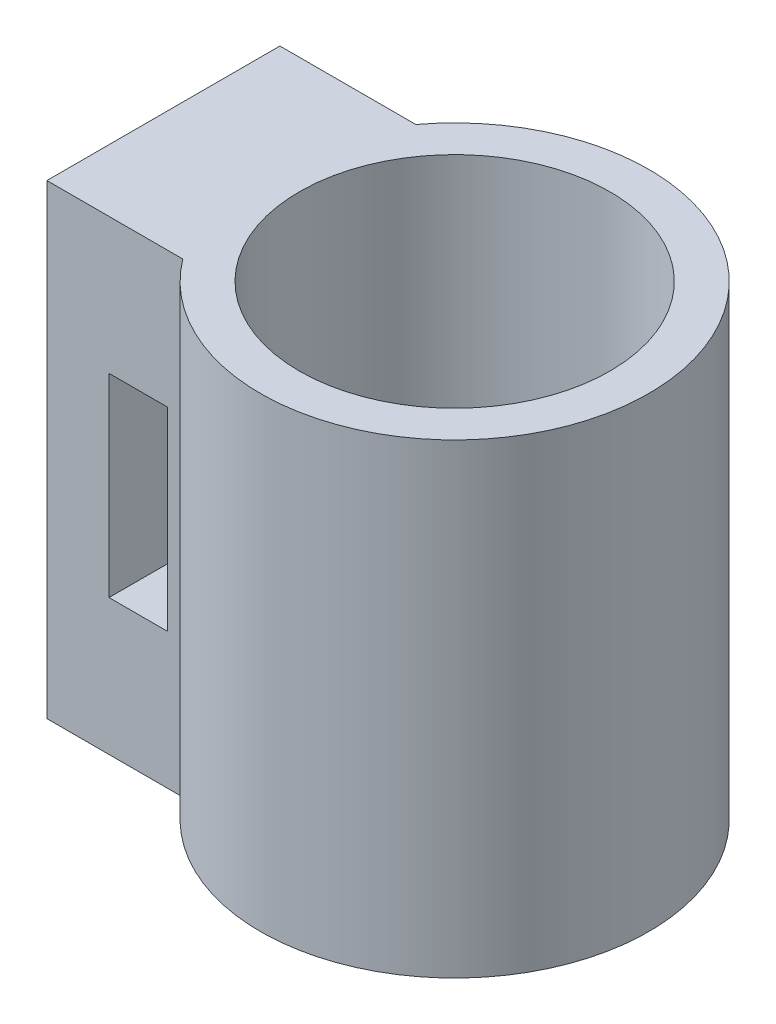
ISO-10303-21;
HEADER;
FILE_DESCRIPTION(('STEP AP214'),'2;1');
FILE_NAME('part.step','',(''),(''),'','','');
FILE_SCHEMA(('AUTOMOTIVE_DESIGN { 1 0 10303 214 1 1 1 1 }'));
ENDSEC;
DATA;
#1=APPLICATION_CONTEXT('core data for automotive mechanical design processes');
#2=APPLICATION_PROTOCOL_DEFINITION('international standard','automotive_design',2000,#1);
#3=PRODUCT_CONTEXT('',#1,'mechanical');
#4=PRODUCT('Part','Part','',(#3));
#5=PRODUCT_RELATED_PRODUCT_CATEGORY('part','',(#4));
#6=PRODUCT_DEFINITION_FORMATION('','',#4);
#7=PRODUCT_DEFINITION_CONTEXT('part definition',#1,'design');
#8=PRODUCT_DEFINITION('design','',#6,#7);
#9=PRODUCT_DEFINITION_SHAPE('','',#8);
#10=(LENGTH_UNIT() NAMED_UNIT(*) SI_UNIT(.MILLI.,.METRE.));
#11=(NAMED_UNIT(*) PLANE_ANGLE_UNIT() SI_UNIT($,.RADIAN.));
#12=(NAMED_UNIT(*) SI_UNIT($,.STERADIAN.) SOLID_ANGLE_UNIT());
#13=UNCERTAINTY_MEASURE_WITH_UNIT(LENGTH_MEASURE(1.E-05),#10,'distance_accuracy_value','');
#14=(GEOMETRIC_REPRESENTATION_CONTEXT(3) GLOBAL_UNCERTAINTY_ASSIGNED_CONTEXT((#13)) GLOBAL_UNIT_ASSIGNED_CONTEXT((#10,
#11,#12)) REPRESENTATION_CONTEXT('',''));
#15=CARTESIAN_POINT('',(0.,0.,0.));
#16=DIRECTION('',(0.,0.,1.));
#17=DIRECTION('',(1.,0.,0.));
#18=AXIS2_PLACEMENT_3D('',#15,#16,#17);
#19=CARTESIAN_POINT('',(0.,-6.,0.));
#20=DIRECTION('',(0.,1.,0.));
#21=DIRECTION('',(0.,0.,1.));
#22=AXIS2_PLACEMENT_3D('',#19,#20,#21);
#23=CYLINDRICAL_SURFACE('',#22,5.);
#24=DIRECTION('',(0.,1.,0.));
#25=VECTOR('',#24,1.);
#26=CARTESIAN_POINT('',(-4.,-6.,-3.));
#27=LINE('',#26,#25);
#28=CARTESIAN_POINT('',(-4.,-6.,-3.));
#29=VERTEX_POINT('',#28);
#30=CARTESIAN_POINT('',(-4.,6.,-3.));
#31=VERTEX_POINT('',#30);
#32=EDGE_CURVE('E42',#29,#31,#27,.T.);
#33=ORIENTED_EDGE('',*,*,#32,.T.);
#34=CARTESIAN_POINT('',(0.,6.,0.));
#35=DIRECTION('',(0.,1.,0.));
#36=DIRECTION('',(0.,0.,1.));
#37=AXIS2_PLACEMENT_3D('',#34,#35,#36);
#38=CIRCLE('',#37,5.);
#39=CARTESIAN_POINT('',(-4.,6.,3.));
#40=VERTEX_POINT('',#39);
#41=EDGE_CURVE('E155',#40,#31,#38,.T.);
#42=ORIENTED_EDGE('',*,*,#41,.F.);
#43=DIRECTION('',(0.,1.,0.));
#44=VECTOR('',#43,1.);
#45=CARTESIAN_POINT('',(-4.,-6.,3.));
#46=LINE('',#45,#44);
#47=CARTESIAN_POINT('',(-4.,-6.,3.));
#48=VERTEX_POINT('',#47);
#49=EDGE_CURVE('E11',#48,#40,#46,.T.);
#50=ORIENTED_EDGE('',*,*,#49,.F.);
#51=CARTESIAN_POINT('',(0.,-6.,0.));
#52=DIRECTION('',(0.,1.,0.));
#53=DIRECTION('',(0.,0.,1.));
#54=AXIS2_PLACEMENT_3D('',#51,#52,#53);
#55=CIRCLE('',#54,5.);
#56=EDGE_CURVE('E175',#48,#29,#55,.T.);
#57=ORIENTED_EDGE('',*,*,#56,.T.);
#58=EDGE_LOOP('',(#33,#42,#50,#57));
#59=FACE_BOUND('',#58,.T.);
#60=ADVANCED_FACE('F39',(#59),#23,.T.);
#61=CARTESIAN_POINT('',(-4.,-6.,3.));
#62=DIRECTION('',(0.,0.,1.));
#63=DIRECTION('',(1.,0.,0.));
#64=AXIS2_PLACEMENT_3D('',#61,#62,#63);
#65=PLANE('',#64);
#66=DIRECTION('',(-1.,0.,0.));
#67=VECTOR('',#66,1.);
#68=CARTESIAN_POINT('',(-4.,2.5,3.));
#69=LINE('',#68,#67);
#70=CARTESIAN_POINT('',(-4.4,2.5,3.));
#71=VERTEX_POINT('',#70);
#72=CARTESIAN_POINT('',(-5.9,2.5,3.));
#73=VERTEX_POINT('',#72);
#74=EDGE_CURVE('E148',#71,#73,#69,.T.);
#75=ORIENTED_EDGE('',*,*,#74,.F.);
#76=DIRECTION('',(0.,1.,0.));
#77=VECTOR('',#76,1.);
#78=CARTESIAN_POINT('',(-4.4,-6.,3.));
#79=LINE('',#78,#77);
#80=CARTESIAN_POINT('',(-4.4,-2.5,3.));
#81=VERTEX_POINT('',#80);
#82=EDGE_CURVE('E136',#81,#71,#79,.T.);
#83=ORIENTED_EDGE('',*,*,#82,.F.);
#84=DIRECTION('',(1.,0.,0.));
#85=VECTOR('',#84,1.);
#86=CARTESIAN_POINT('',(-4.,-2.5,3.));
#87=LINE('',#86,#85);
#88=CARTESIAN_POINT('',(-5.9,-2.5,3.));
#89=VERTEX_POINT('',#88);
#90=EDGE_CURVE('E111',#89,#81,#87,.T.);
#91=ORIENTED_EDGE('',*,*,#90,.F.);
#92=DIRECTION('',(0.,-1.,0.));
#93=VECTOR('',#92,1.);
#94=CARTESIAN_POINT('',(-5.9,-6.,3.));
#95=LINE('',#94,#93);
#96=EDGE_CURVE('E145',#73,#89,#95,.T.);
#97=ORIENTED_EDGE('',*,*,#96,.F.);
#98=EDGE_LOOP('',(#75,#83,#91,#97));
#99=FACE_BOUND('',#98,.T.);
#100=ORIENTED_EDGE('',*,*,#49,.T.);
#101=DIRECTION('',(1.,0.,0.));
#102=VECTOR('',#101,1.);
#103=CARTESIAN_POINT('',(-4.,6.,3.));
#104=LINE('',#103,#102);
#105=CARTESIAN_POINT('',(-7.5,6.,3.));
#106=VERTEX_POINT('',#105);
#107=EDGE_CURVE('E167',#106,#40,#104,.T.);
#108=ORIENTED_EDGE('',*,*,#107,.F.);
#109=DIRECTION('',(0.,1.,0.));
#110=VECTOR('',#109,1.);
#111=CARTESIAN_POINT('',(-7.5,-6.,3.));
#112=LINE('',#111,#110);
#113=CARTESIAN_POINT('',(-7.5,-6.,3.));
#114=VERTEX_POINT('',#113);
#115=EDGE_CURVE('E48',#114,#106,#112,.T.);
#116=ORIENTED_EDGE('',*,*,#115,.F.);
#117=DIRECTION('',(1.,0.,0.));
#118=VECTOR('',#117,1.);
#119=CARTESIAN_POINT('',(-4.,-6.,3.));
#120=LINE('',#119,#118);
#121=EDGE_CURVE('E187',#114,#48,#120,.T.);
#122=ORIENTED_EDGE('',*,*,#121,.T.);
#123=EDGE_LOOP('',(#100,#108,#116,#122));
#124=FACE_BOUND('',#123,.T.);
#125=ADVANCED_FACE('F206',(#99,#124),#65,.T.);
#126=CARTESIAN_POINT('',(-7.5,-6.,-3.));
#127=DIRECTION('',(-1.,0.,0.));
#128=DIRECTION('',(0.,0.,1.));
#129=AXIS2_PLACEMENT_3D('',#126,#127,#128);
#130=PLANE('',#129);
#131=ORIENTED_EDGE('',*,*,#115,.T.);
#132=DIRECTION('',(0.,0.,1.));
#133=VECTOR('',#132,1.);
#134=CARTESIAN_POINT('',(-7.5,6.,-3.));
#135=LINE('',#134,#133);
#136=CARTESIAN_POINT('',(-7.5,6.,-3.));
#137=VERTEX_POINT('',#136);
#138=EDGE_CURVE('E163',#137,#106,#135,.T.);
#139=ORIENTED_EDGE('',*,*,#138,.F.);
#140=DIRECTION('',(0.,1.,0.));
#141=VECTOR('',#140,1.);
#142=CARTESIAN_POINT('',(-7.5,-6.,-3.));
#143=LINE('',#142,#141);
#144=CARTESIAN_POINT('',(-7.5,-6.,-3.));
#145=VERTEX_POINT('',#144);
#146=EDGE_CURVE('E192',#145,#137,#143,.T.);
#147=ORIENTED_EDGE('',*,*,#146,.F.);
#148=DIRECTION('',(0.,0.,1.));
#149=VECTOR('',#148,1.);
#150=CARTESIAN_POINT('',(-7.5,-6.,-3.));
#151=LINE('',#150,#149);
#152=EDGE_CURVE('E183',#145,#114,#151,.T.);
#153=ORIENTED_EDGE('',*,*,#152,.T.);
#154=EDGE_LOOP('',(#131,#139,#147,#153));
#155=FACE_BOUND('',#154,.T.);
#156=ADVANCED_FACE('F212',(#155),#130,.T.);
#157=CARTESIAN_POINT('',(-4.,-6.,-3.));
#158=DIRECTION('',(0.,0.,-1.));
#159=DIRECTION('',(-1.,0.,0.));
#160=AXIS2_PLACEMENT_3D('',#157,#158,#159);
#161=PLANE('',#160);
#162=DIRECTION('',(1.,0.,0.));
#163=VECTOR('',#162,1.);
#164=CARTESIAN_POINT('',(-4.4,2.5,-3.));
#165=LINE('',#164,#163);
#166=CARTESIAN_POINT('',(-5.9,2.5,-3.));
#167=VERTEX_POINT('',#166);
#168=CARTESIAN_POINT('',(-4.4,2.5,-3.));
#169=VERTEX_POINT('',#168);
#170=EDGE_CURVE('E64',#167,#169,#165,.T.);
#171=ORIENTED_EDGE('',*,*,#170,.F.);
#172=DIRECTION('',(0.,1.,0.));
#173=VECTOR('',#172,1.);
#174=CARTESIAN_POINT('',(-5.9,2.5,-3.));
#175=LINE('',#174,#173);
#176=CARTESIAN_POINT('',(-5.9,-2.5,-3.));
#177=VERTEX_POINT('',#176);
#178=EDGE_CURVE('E126',#177,#167,#175,.T.);
#179=ORIENTED_EDGE('',*,*,#178,.F.);
#180=DIRECTION('',(-1.,0.,0.));
#181=VECTOR('',#180,1.);
#182=CARTESIAN_POINT('',(-4.4,-2.5,-3.));
#183=LINE('',#182,#181);
#184=CARTESIAN_POINT('',(-4.4,-2.5,-3.));
#185=VERTEX_POINT('',#184);
#186=EDGE_CURVE('E108',#185,#177,#183,.T.);
#187=ORIENTED_EDGE('',*,*,#186,.F.);
#188=DIRECTION('',(0.,-1.,0.));
#189=VECTOR('',#188,1.);
#190=CARTESIAN_POINT('',(-4.4,-2.5,-3.));
#191=LINE('',#190,#189);
#192=EDGE_CURVE('E118',#169,#185,#191,.T.);
#193=ORIENTED_EDGE('',*,*,#192,.F.);
#194=EDGE_LOOP('',(#171,#179,#187,#193));
#195=FACE_BOUND('',#194,.T.);
#196=ORIENTED_EDGE('',*,*,#146,.T.);
#197=DIRECTION('',(-1.,0.,0.));
#198=VECTOR('',#197,1.);
#199=CARTESIAN_POINT('',(-4.,6.,-3.));
#200=LINE('',#199,#198);
#201=EDGE_CURVE('E159',#31,#137,#200,.T.);
#202=ORIENTED_EDGE('',*,*,#201,.F.);
#203=ORIENTED_EDGE('',*,*,#32,.F.);
#204=DIRECTION('',(-1.,0.,0.));
#205=VECTOR('',#204,1.);
#206=CARTESIAN_POINT('',(-4.,-6.,-3.));
#207=LINE('',#206,#205);
#208=EDGE_CURVE('E179',#29,#145,#207,.T.);
#209=ORIENTED_EDGE('',*,*,#208,.T.);
#210=EDGE_LOOP('',(#196,#202,#203,#209));
#211=FACE_BOUND('',#210,.T.);
#212=ADVANCED_FACE('F123',(#195,#211),#161,.T.);
#213=CARTESIAN_POINT('',(0.,-6.,0.));
#214=DIRECTION('',(0.,1.,0.));
#215=DIRECTION('',(0.,0.,1.));
#216=AXIS2_PLACEMENT_3D('',#213,#214,#215);
#217=PLANE('',#216);
#218=CARTESIAN_POINT('',(0.,-6.,0.));
#219=DIRECTION('',(0.,1.,0.));
#220=DIRECTION('',(0.,0.,1.));
#221=AXIS2_PLACEMENT_3D('',#218,#219,#220);
#222=CIRCLE('',#221,4.);
#223=CARTESIAN_POINT('',(0.,-6.,4.));
#224=VERTEX_POINT('',#223);
#225=EDGE_CURVE('E171',#224,#224,#222,.T.);
#226=ORIENTED_EDGE('',*,*,#225,.T.);
#227=EDGE_LOOP('',(#226));
#228=FACE_BOUND('',#227,.T.);
#229=ORIENTED_EDGE('',*,*,#56,.F.);
#230=ORIENTED_EDGE('',*,*,#121,.F.);
#231=ORIENTED_EDGE('',*,*,#152,.F.);
#232=ORIENTED_EDGE('',*,*,#208,.F.);
#233=EDGE_LOOP('',(#229,#230,#231,#232));
#234=FACE_BOUND('',#233,.T.);
#235=ADVANCED_FACE('F209',(#228,#234),#217,.F.);
#236=CARTESIAN_POINT('',(0.,-6.,0.));
#237=DIRECTION('',(0.,1.,0.));
#238=DIRECTION('',(0.,0.,1.));
#239=AXIS2_PLACEMENT_3D('',#236,#237,#238);
#240=CYLINDRICAL_SURFACE('',#239,4.);
#241=ORIENTED_EDGE('',*,*,#225,.F.);
#242=EDGE_LOOP('',(#241));
#243=FACE_BOUND('',#242,.T.);
#244=CARTESIAN_POINT('',(0.,6.,0.));
#245=DIRECTION('',(0.,1.,0.));
#246=DIRECTION('',(0.,0.,1.));
#247=AXIS2_PLACEMENT_3D('',#244,#245,#246);
#248=CIRCLE('',#247,4.);
#249=CARTESIAN_POINT('',(0.,6.,4.));
#250=VERTEX_POINT('',#249);
#251=EDGE_CURVE('E151',#250,#250,#248,.T.);
#252=ORIENTED_EDGE('',*,*,#251,.T.);
#253=EDGE_LOOP('',(#252));
#254=FACE_BOUND('',#253,.T.);
#255=ADVANCED_FACE('F283',(#243,#254),#240,.F.);
#256=CARTESIAN_POINT('',(0.,6.,0.));
#257=DIRECTION('',(0.,1.,0.));
#258=DIRECTION('',(0.,0.,1.));
#259=AXIS2_PLACEMENT_3D('',#256,#257,#258);
#260=PLANE('',#259);
#261=ORIENTED_EDGE('',*,*,#41,.T.);
#262=ORIENTED_EDGE('',*,*,#201,.T.);
#263=ORIENTED_EDGE('',*,*,#138,.T.);
#264=ORIENTED_EDGE('',*,*,#107,.T.);
#265=EDGE_LOOP('',(#261,#262,#263,#264));
#266=FACE_BOUND('',#265,.T.);
#267=ORIENTED_EDGE('',*,*,#251,.F.);
#268=EDGE_LOOP('',(#267));
#269=FACE_BOUND('',#268,.T.);
#270=ADVANCED_FACE('F202',(#266,#269),#260,.T.);
#271=CARTESIAN_POINT('',(-4.4,2.5,5.));
#272=DIRECTION('',(0.,1.,0.));
#273=DIRECTION('',(0.,0.,1.));
#274=AXIS2_PLACEMENT_3D('',#271,#272,#273);
#275=PLANE('',#274);
#276=ORIENTED_EDGE('',*,*,#74,.T.);
#277=DIRECTION('',(0.,0.,-1.));
#278=VECTOR('',#277,1.);
#279=CARTESIAN_POINT('',(-5.9,2.5,5.));
#280=LINE('',#279,#278);
#281=EDGE_CURVE('E133',#73,#167,#280,.T.);
#282=ORIENTED_EDGE('',*,*,#281,.T.);
#283=ORIENTED_EDGE('',*,*,#170,.T.);
#284=DIRECTION('',(0.,0.,-1.));
#285=VECTOR('',#284,1.);
#286=CARTESIAN_POINT('',(-4.4,2.5,5.));
#287=LINE('',#286,#285);
#288=EDGE_CURVE('E115',#71,#169,#287,.T.);
#289=ORIENTED_EDGE('',*,*,#288,.F.);
#290=EDGE_LOOP('',(#276,#282,#283,#289));
#291=FACE_BOUND('',#290,.T.);
#292=ADVANCED_FACE('F247',(#291),#275,.F.);
#293=CARTESIAN_POINT('',(-5.9,2.5,5.));
#294=DIRECTION('',(-1.,0.,0.));
#295=DIRECTION('',(0.,0.,1.));
#296=AXIS2_PLACEMENT_3D('',#293,#294,#295);
#297=PLANE('',#296);
#298=ORIENTED_EDGE('',*,*,#96,.T.);
#299=DIRECTION('',(0.,0.,-1.));
#300=VECTOR('',#299,1.);
#301=CARTESIAN_POINT('',(-5.9,-2.5,5.));
#302=LINE('',#301,#300);
#303=EDGE_CURVE('E114',#89,#177,#302,.T.);
#304=ORIENTED_EDGE('',*,*,#303,.T.);
#305=ORIENTED_EDGE('',*,*,#178,.T.);
#306=ORIENTED_EDGE('',*,*,#281,.F.);
#307=EDGE_LOOP('',(#298,#304,#305,#306));
#308=FACE_BOUND('',#307,.T.);
#309=ADVANCED_FACE('F252',(#308),#297,.F.);
#310=CARTESIAN_POINT('',(-4.4,-2.5,5.));
#311=DIRECTION('',(0.,-1.,0.));
#312=DIRECTION('',(0.,0.,-1.));
#313=AXIS2_PLACEMENT_3D('',#310,#311,#312);
#314=PLANE('',#313);
#315=ORIENTED_EDGE('',*,*,#90,.T.);
#316=DIRECTION('',(0.,0.,-1.));
#317=VECTOR('',#316,1.);
#318=CARTESIAN_POINT('',(-4.4,-2.5,5.));
#319=LINE('',#318,#317);
#320=EDGE_CURVE('E56',#81,#185,#319,.T.);
#321=ORIENTED_EDGE('',*,*,#320,.T.);
#322=ORIENTED_EDGE('',*,*,#186,.T.);
#323=ORIENTED_EDGE('',*,*,#303,.F.);
#324=EDGE_LOOP('',(#315,#321,#322,#323));
#325=FACE_BOUND('',#324,.T.);
#326=ADVANCED_FACE('F105',(#325),#314,.F.);
#327=CARTESIAN_POINT('',(-4.4,-2.5,5.));
#328=DIRECTION('',(1.,0.,0.));
#329=DIRECTION('',(0.,0.,-1.));
#330=AXIS2_PLACEMENT_3D('',#327,#328,#329);
#331=PLANE('',#330);
#332=ORIENTED_EDGE('',*,*,#82,.T.);
#333=ORIENTED_EDGE('',*,*,#288,.T.);
#334=ORIENTED_EDGE('',*,*,#192,.T.);
#335=ORIENTED_EDGE('',*,*,#320,.F.);
#336=EDGE_LOOP('',(#332,#333,#334,#335));
#337=FACE_BOUND('',#336,.T.);
#338=ADVANCED_FACE('F119',(#337),#331,.F.);
#339=CLOSED_SHELL('',(#60,#125,#156,#212,#235,#255,#270,#292,#309,#326,#338));
#340=MANIFOLD_SOLID_BREP('B2',#339);
#341=ADVANCED_BREP_SHAPE_REPRESENTATION('',(#18,#340),#14);
#342=SHAPE_DEFINITION_REPRESENTATION(#9,#341);
ENDSEC;
END-ISO-10303-21;
